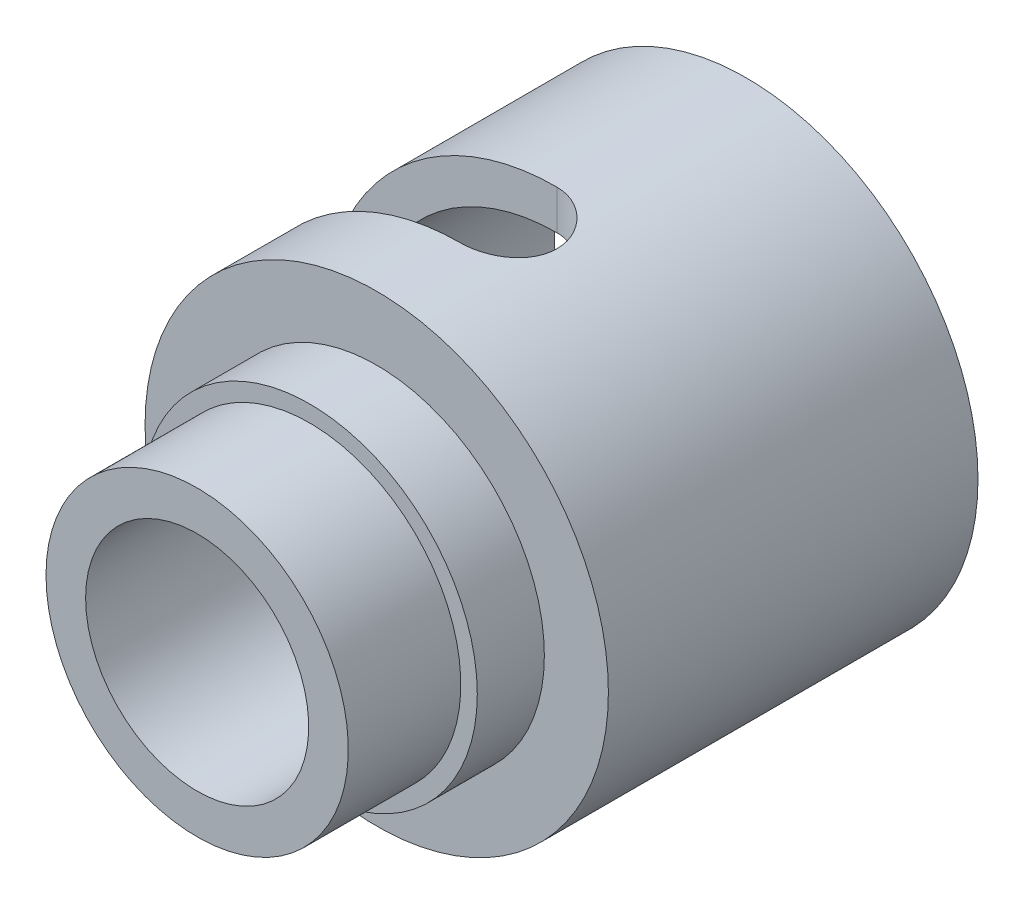
ISO-10303-21;
HEADER;
FILE_DESCRIPTION(('STEP AP214'),'2;1');
FILE_NAME('part.step','',(''),(''),'','','');
FILE_SCHEMA(('AUTOMOTIVE_DESIGN { 1 0 10303 214 1 1 1 1 }'));
ENDSEC;
DATA;
#1=APPLICATION_CONTEXT('core data for automotive mechanical design processes');
#2=APPLICATION_PROTOCOL_DEFINITION('international standard','automotive_design',2000,#1);
#3=PRODUCT_CONTEXT('',#1,'mechanical');
#4=PRODUCT('Part','Part','',(#3));
#5=PRODUCT_RELATED_PRODUCT_CATEGORY('part','',(#4));
#6=PRODUCT_DEFINITION_FORMATION('','',#4);
#7=PRODUCT_DEFINITION_CONTEXT('part definition',#1,'design');
#8=PRODUCT_DEFINITION('design','',#6,#7);
#9=PRODUCT_DEFINITION_SHAPE('','',#8);
#10=(LENGTH_UNIT() NAMED_UNIT(*) SI_UNIT(.MILLI.,.METRE.));
#11=(NAMED_UNIT(*) PLANE_ANGLE_UNIT() SI_UNIT($,.RADIAN.));
#12=(NAMED_UNIT(*) SI_UNIT($,.STERADIAN.) SOLID_ANGLE_UNIT());
#13=UNCERTAINTY_MEASURE_WITH_UNIT(LENGTH_MEASURE(1.E-05),#10,'distance_accuracy_value','');
#14=(GEOMETRIC_REPRESENTATION_CONTEXT(3) GLOBAL_UNCERTAINTY_ASSIGNED_CONTEXT((#13)) GLOBAL_UNIT_ASSIGNED_CONTEXT((#10,
#11,#12)) REPRESENTATION_CONTEXT('',''));
#15=CARTESIAN_POINT('',(0.,0.,0.));
#16=DIRECTION('',(0.,0.,1.));
#17=DIRECTION('',(1.,0.,0.));
#18=AXIS2_PLACEMENT_3D('',#15,#16,#17);
#19=CARTESIAN_POINT('',(0.,0.,0.));
#20=DIRECTION('',(0.,0.,-1.));
#21=DIRECTION('',(-1.,0.,0.));
#22=AXIS2_PLACEMENT_3D('',#19,#20,#21);
#23=CYLINDRICAL_SURFACE('',#22,7.2754);
#24=CARTESIAN_POINT('',(0.,0.,-20.802));
#25=DIRECTION('',(0.,0.,-1.));
#26=DIRECTION('',(-1.,0.,0.));
#27=AXIS2_PLACEMENT_3D('',#24,#25,#26);
#28=CIRCLE('',#27,7.2754);
#29=CARTESIAN_POINT('',(-7.2754,0.,-20.802));
#30=VERTEX_POINT('',#29);
#31=EDGE_CURVE('E154',#30,#30,#28,.T.);
#32=ORIENTED_EDGE('',*,*,#31,.T.);
#33=EDGE_LOOP('',(#32));
#34=FACE_BOUND('',#33,.T.);
#35=CARTESIAN_POINT('',(0.,0.,-7.802));
#36=DIRECTION('',(0.,0.,-1.));
#37=DIRECTION('',(-1.,0.,0.));
#38=AXIS2_PLACEMENT_3D('',#35,#36,#37);
#39=CIRCLE('',#38,7.2754);
#40=CARTESIAN_POINT('',(-7.2754,0.,-7.802));
#41=VERTEX_POINT('',#40);
#42=EDGE_CURVE('E151',#41,#41,#39,.T.);
#43=ORIENTED_EDGE('',*,*,#42,.F.);
#44=EDGE_LOOP('',(#43));
#45=FACE_BOUND('',#44,.T.);
#46=CARTESIAN_POINT('',(-7.2754,0.,-9.9732));
#47=CARTESIAN_POINT('',(-7.27539830402765,-0.101024499946564,-9.97320280234613));
#48=CARTESIAN_POINT('',(-7.27327485266159,-0.202080196573058,-9.9815991741987));
#49=CARTESIAN_POINT('',(-7.26500978027613,-0.401294142732307,-10.0149117852201));
#50=CARTESIAN_POINT('',(-7.25886590940929,-0.499450737749958,-10.0398372742727));
#51=CARTESIAN_POINT('',(-7.24324015798296,-0.689960986716793,-10.1053569311408));
#52=CARTESIAN_POINT('',(-7.23376231088969,-0.782321494408743,-10.1459321714814));
#53=CARTESIAN_POINT('',(-7.21247738243091,-0.958925002909971,-10.2415326746814));
#54=CARTESIAN_POINT('',(-7.20067021626212,-1.04316770800902,-10.2965584636646));
#55=CARTESIAN_POINT('',(-7.17573326326539,-1.20289688977567,-10.4207072107326));
#56=CARTESIAN_POINT('',(-7.16258289181062,-1.27819042998377,-10.4900742770674));
#57=CARTESIAN_POINT('',(-7.13657804400276,-1.41620693804382,-10.6404139312616));
#58=CARTESIAN_POINT('',(-7.12372360156639,-1.47892847129141,-10.7213878417835));
#59=CARTESIAN_POINT('',(-7.09955826488381,-1.59093058935488,-10.8941440590972));
#60=CARTESIAN_POINT('',(-7.08827349027227,-1.63999485862079,-10.9860705946166));
#61=CARTESIAN_POINT('',(-7.06882558457157,-1.72189842322642,-11.1771964936568));
#62=CARTESIAN_POINT('',(-7.06066194843538,-1.75474034383683,-11.2763946774172));
#63=CARTESIAN_POINT('',(-7.0485922757255,-1.80260780974885,-11.4771252578249));
#64=CARTESIAN_POINT('',(-7.04460341265171,-1.81798049186806,-11.5785697775956));
#65=CARTESIAN_POINT('',(-7.0410870325231,-1.83155446153518,-11.7826702894379));
#66=CARTESIAN_POINT('',(-7.04155878117181,-1.82975857533599,-11.8853260793341));
#67=CARTESIAN_POINT('',(-7.04683589616991,-1.80932324260116,-12.0862706981259));
#68=CARTESIAN_POINT('',(-7.05153469853574,-1.79109795781843,-12.184604882051));
#69=CARTESIAN_POINT('',(-7.06456659296153,-1.73898206788859,-12.3767731897796));
#70=CARTESIAN_POINT('',(-7.0728999464572,-1.70509033583279,-12.4706069893283));
#71=CARTESIAN_POINT('',(-7.09235946653254,-1.62225190572411,-12.6522190127621));
#72=CARTESIAN_POINT('',(-7.10351322830426,-1.57315530728083,-12.7399257817411));
#73=CARTESIAN_POINT('',(-7.1273412977001,-1.46140563294241,-12.906004104758));
#74=CARTESIAN_POINT('',(-7.14001587390704,-1.39875016091331,-12.9843740049771));
#75=CARTESIAN_POINT('',(-7.16590574531014,-1.25951819962062,-13.1319267904066));
#76=CARTESIAN_POINT('',(-7.17912609289931,-1.18259234598438,-13.2007795440711));
#77=CARTESIAN_POINT('',(-7.20428843481481,-1.01812734655254,-13.3246705401997));
#78=CARTESIAN_POINT('',(-7.21623038923822,-0.930587869652059,-13.3797083515255));
#79=CARTESIAN_POINT('',(-7.23755091455376,-0.746906299806735,-13.4745302831887));
#80=CARTESIAN_POINT('',(-7.24692035881741,-0.650735144417063,-13.5142602911913));
#81=CARTESIAN_POINT('',(-7.26197384057994,-0.452790912351929,-13.5768972911292));
#82=CARTESIAN_POINT('',(-7.2676585909855,-0.351018923450167,-13.5998075374297));
#83=CARTESIAN_POINT('',(-7.27459648518906,-0.147584117427005,-13.6276493659367));
#84=CARTESIAN_POINT('',(-7.27596040572397,-0.0459865074428848,-13.6330304620862));
#85=CARTESIAN_POINT('',(-7.27441871372347,0.1566577357541,-13.6268948160831));
#86=CARTESIAN_POINT('',(-7.27151349001896,0.257704418303768,-13.6153796128346));
#87=CARTESIAN_POINT('',(-7.26183097878239,0.454813046329619,-13.5761486217887));
#88=CARTESIAN_POINT('',(-7.25511244226587,0.55092703543925,-13.5486785021458));
#89=CARTESIAN_POINT('',(-7.23856093199773,0.737177293925065,-13.4785984362942));
#90=CARTESIAN_POINT('',(-7.22872764174585,0.827312954697677,-13.4359869514685));
#91=CARTESIAN_POINT('',(-7.20677254011678,1.00083305357398,-13.3359655593183));
#92=CARTESIAN_POINT('',(-7.19461292141622,1.08406779801983,-13.2783044580672));
#93=CARTESIAN_POINT('',(-7.16941285769906,1.2398392703405,-13.1501412749587));
#94=CARTESIAN_POINT('',(-7.15637225916173,1.31237412659097,-13.0796369513738));
#95=CARTESIAN_POINT('',(-7.13048052409588,1.44654259372017,-12.9257006855771));
#96=CARTESIAN_POINT('',(-7.11764213635493,1.5078607281826,-12.8419911674274));
#97=CARTESIAN_POINT('',(-7.09396935116463,1.61557961426915,-12.6652056661462));
#98=CARTESIAN_POINT('',(-7.08313486500684,1.66198102629176,-12.5721300979113));
#99=CARTESIAN_POINT('',(-7.06481649831764,1.73820320288498,-12.3797517165542));
#100=CARTESIAN_POINT('',(-7.05731282763733,1.76812216179596,-12.2804897922661));
#101=CARTESIAN_POINT('',(-7.04648770316062,1.81078706726278,-12.0781269929175));
#102=CARTESIAN_POINT('',(-7.04316532273453,1.82353681878783,-11.9750269736463));
#103=CARTESIAN_POINT('',(-7.04115012892888,1.83130094249512,-11.7711264382262));
#104=CARTESIAN_POINT('',(-7.04232563257799,1.82681975952551,-11.6703461260569));
#105=CARTESIAN_POINT('',(-7.04886899295589,1.80140497185587,-11.4710276115858));
#106=CARTESIAN_POINT('',(-7.05423676363589,1.7804717048447,-11.372489363307));
#107=CARTESIAN_POINT('',(-7.06848604601725,1.72302386809477,-11.1810074878381));
#108=CARTESIAN_POINT('',(-7.07734597612278,1.68660489332989,-11.0880334638543));
#109=CARTESIAN_POINT('',(-7.09758410917251,1.59929494143329,-10.9094485509126));
#110=CARTESIAN_POINT('',(-7.10896266512975,1.54840193532217,-10.8238386964618));
#111=CARTESIAN_POINT('',(-7.13333066664447,1.43201131925322,-10.6599770166895));
#112=CARTESIAN_POINT('',(-7.14635466426104,1.36616414923033,-10.5819785809128));
#113=CARTESIAN_POINT('',(-7.17234089323796,1.22241425733302,-10.4379742844702));
#114=CARTESIAN_POINT('',(-7.18530310917109,1.14450867189061,-10.3719712805308));
#115=CARTESIAN_POINT('',(-7.20998939943023,0.97712661207887,-10.2526487568694));
#116=CARTESIAN_POINT('',(-7.22168636365133,0.887463914686861,-10.1995844288468));
#117=CARTESIAN_POINT('',(-7.24223740571885,0.700204149436921,-10.1093665734671));
#118=CARTESIAN_POINT('',(-7.25109350278181,0.602612779189115,-10.0722017388551));
#119=CARTESIAN_POINT('',(-7.26366871794279,0.421008502340967,-10.0203014416514));
#120=CARTESIAN_POINT('',(-7.26803758526761,0.337854398316298,-10.0026768034518));
#121=CARTESIAN_POINT('',(-7.27390382860617,0.16980745351004,-9.9791253548518));
#122=CARTESIAN_POINT('',(-7.27540142552612,0.0849147469988232,-9.9731976445267));
#123=CARTESIAN_POINT('',(-7.2754,0.,-9.9732));
#124=B_SPLINE_CURVE_WITH_KNOTS('',3,(#46,#47,#48,#49,#50,#51,#52,#53,#54,#55,#56,#57,#58,#59,
#60,#61,#62,#63,#64,#65,#66,#67,#68,#69,#70,#71,#72,#73,#74,#75,#76,#77,#78,#79,#80,#81,#82,#83,
#84,#85,#86,#87,#88,#89,#90,#91,#92,#93,#94,#95,#96,#97,#98,#99,#100,#101,#102,#103,#104,#105,
#106,#107,#108,#109,#110,#111,#112,#113,#114,#115,#116,#117,#118,#119,#120,#121,#122,#123),
.UNSPECIFIED.,.T.,.F.,(4,2,2,2,2,2,2,2,2,2,2,2,2,2,2,2,2,2,2,2,2,2,2,2,2,2,2,2,2,2,2,2,2,2,2,2,
2,2,4),(0.,0.302762300730394,0.605694173858794,0.908260811378282,1.21083846644243,
1.51906761782229,1.8273319215424,2.1402320371915,2.45308149945712,2.75959912914612,
3.06606630142926,3.36501748841829,3.66399018271642,3.96600960592029,4.26808244586448,
4.57886693898976,4.8896611299104,5.20154409817887,5.51336670597252,5.81712731388759,
6.12086025719801,6.42003594955192,6.71924205187987,7.0238029360173,7.32841703093051,
7.64059634584569,7.9527618379424,8.2630469160116,8.57326321865359,8.87446789057155,
9.17566638024482,9.47503193168337,9.77443946908728,10.0817380252804,10.3891096693717,
10.7021261624938,11.0149196758842,11.2694219241324,11.5239045910191),.UNSPECIFIED.);
#125=CARTESIAN_POINT('',(-7.2754,0.,-9.9732));
#126=VERTEX_POINT('',#125);
#127=CARTESIAN_POINT('',(-7.2754,0.,-13.6308));
#128=VERTEX_POINT('',#127);
#129=EDGE_CURVE('E109',#126,#128,#124,.T.);
#130=ORIENTED_EDGE('',*,*,#129,.F.);
#131=CARTESIAN_POINT('',(0.,0.,-9.9732));
#132=DIRECTION('',(0.,0.,-1.));
#133=DIRECTION('',(-1.,0.,0.));
#134=AXIS2_PLACEMENT_3D('',#131,#132,#133);
#135=CIRCLE('',#134,7.2754);
#136=CARTESIAN_POINT('',(0.,7.2754,-9.9732));
#137=VERTEX_POINT('',#136);
#138=EDGE_CURVE('E54',#126,#137,#135,.T.);
#139=ORIENTED_EDGE('',*,*,#138,.T.);
#140=CARTESIAN_POINT('',(0.,7.2754,-13.6308));
#141=CARTESIAN_POINT('',(-0.101024499946564,7.27539830402765,-13.6307971976539));
#142=CARTESIAN_POINT('',(-0.202080196573058,7.27327485266159,-13.6224008258013));
#143=CARTESIAN_POINT('',(-0.401294142732307,7.26500978027613,-13.5890882147799));
#144=CARTESIAN_POINT('',(-0.499450737749958,7.25886590940929,-13.5641627257273));
#145=CARTESIAN_POINT('',(-0.689960986716793,7.24324015798296,-13.4986430688592));
#146=CARTESIAN_POINT('',(-0.782321494408743,7.23376231088969,-13.4580678285186));
#147=CARTESIAN_POINT('',(-0.958925002909971,7.21247738243091,-13.3624673253186));
#148=CARTESIAN_POINT('',(-1.04316770800902,7.20067021626212,-13.3074415363354));
#149=CARTESIAN_POINT('',(-1.20289688977567,7.17573326326539,-13.1832927892674));
#150=CARTESIAN_POINT('',(-1.27819042998377,7.16258289181062,-13.1139257229326));
#151=CARTESIAN_POINT('',(-1.41620693804382,7.13657804400276,-12.9635860687384));
#152=CARTESIAN_POINT('',(-1.47892847129141,7.12372360156639,-12.8826121582165));
#153=CARTESIAN_POINT('',(-1.59093058935488,7.09955826488381,-12.7098559409028));
#154=CARTESIAN_POINT('',(-1.63999485862079,7.08827349027227,-12.6179294053834));
#155=CARTESIAN_POINT('',(-1.72189842322642,7.06882558457157,-12.4268035063432));
#156=CARTESIAN_POINT('',(-1.75474034383683,7.06066194843538,-12.3276053225828));
#157=CARTESIAN_POINT('',(-1.80260780974885,7.0485922757255,-12.126874742175));
#158=CARTESIAN_POINT('',(-1.81798049186806,7.04460341265171,-12.0254302224044));
#159=CARTESIAN_POINT('',(-1.83155446153518,7.0410870325231,-11.8213297105621));
#160=CARTESIAN_POINT('',(-1.82975857533599,7.04155878117181,-11.7186739206659));
#161=CARTESIAN_POINT('',(-1.80932324260115,7.04683589616991,-11.5177293018741));
#162=CARTESIAN_POINT('',(-1.79109795781843,7.05153469853574,-11.419395117949));
#163=CARTESIAN_POINT('',(-1.73898206788859,7.06456659296153,-11.2272268102204));
#164=CARTESIAN_POINT('',(-1.70509033583279,7.0728999464572,-11.1333930106717));
#165=CARTESIAN_POINT('',(-1.62225190572411,7.09235946653254,-10.9517809872379));
#166=CARTESIAN_POINT('',(-1.57315530728083,7.10351322830426,-10.8640742182589));
#167=CARTESIAN_POINT('',(-1.4614056329424,7.1273412977001,-10.697995895242));
#168=CARTESIAN_POINT('',(-1.39875016091331,7.14001587390704,-10.6196259950229));
#169=CARTESIAN_POINT('',(-1.25951819962062,7.16590574531014,-10.4720732095934));
#170=CARTESIAN_POINT('',(-1.18259234598438,7.17912609289931,-10.4032204559289));
#171=CARTESIAN_POINT('',(-1.01812734655254,7.20428843481481,-10.2793294598003));
#172=CARTESIAN_POINT('',(-0.930587869652058,7.21623038923822,-10.2242916484745));
#173=CARTESIAN_POINT('',(-0.746906299806734,7.23755091455376,-10.1294697168113));
#174=CARTESIAN_POINT('',(-0.650735144417063,7.24692035881741,-10.0897397088087));
#175=CARTESIAN_POINT('',(-0.452790912351929,7.26197384057994,-10.0271027088708));
#176=CARTESIAN_POINT('',(-0.351018923450168,7.2676585909855,-10.0041924625703));
#177=CARTESIAN_POINT('',(-0.147584117427006,7.27459648518906,-9.97635063406334));
#178=CARTESIAN_POINT('',(-0.0459865074428852,7.27596040572397,-9.97096953791384));
#179=CARTESIAN_POINT('',(0.156657735754099,7.27441871372347,-9.97710518391693));
#180=CARTESIAN_POINT('',(0.257704418303767,7.27151349001896,-9.98862038716539));
#181=CARTESIAN_POINT('',(0.454813046329619,7.26183097878239,-10.0278513782113));
#182=CARTESIAN_POINT('',(0.55092703543925,7.25511244226587,-10.0553214978542));
#183=CARTESIAN_POINT('',(0.737177293925065,7.23856093199773,-10.1254015637058));
#184=CARTESIAN_POINT('',(0.827312954697677,7.22872764174585,-10.1680130485315));
#185=CARTESIAN_POINT('',(1.00083305357397,7.20677254011678,-10.2680344406817));
#186=CARTESIAN_POINT('',(1.08406779801983,7.19461292141622,-10.3256955419328));
#187=CARTESIAN_POINT('',(1.2398392703405,7.16941285769906,-10.4538587250413));
#188=CARTESIAN_POINT('',(1.31237412659097,7.15637225916173,-10.5243630486262));
#189=CARTESIAN_POINT('',(1.44654259372017,7.13048052409588,-10.6782993144229));
#190=CARTESIAN_POINT('',(1.5078607281826,7.11764213635493,-10.7620088325726));
#191=CARTESIAN_POINT('',(1.61557961426915,7.09396935116463,-10.9387943338538));
#192=CARTESIAN_POINT('',(1.66198102629176,7.08313486500684,-11.0318699020887));
#193=CARTESIAN_POINT('',(1.73820320288498,7.06481649831764,-11.2242482834458));
#194=CARTESIAN_POINT('',(1.76812216179596,7.05731282763733,-11.3235102077339));
#195=CARTESIAN_POINT('',(1.81078706726278,7.04648770316062,-11.5258730070825));
#196=CARTESIAN_POINT('',(1.82353681878782,7.04316532273453,-11.6289730263537));
#197=CARTESIAN_POINT('',(1.83130094249512,7.04115012892888,-11.8328735617738));
#198=CARTESIAN_POINT('',(1.82681975952551,7.04232563257799,-11.9336538739431));
#199=CARTESIAN_POINT('',(1.80140497185587,7.04886899295589,-12.1329723884142));
#200=CARTESIAN_POINT('',(1.7804717048447,7.05423676363589,-12.231510636693));
#201=CARTESIAN_POINT('',(1.72302386809477,7.06848604601725,-12.4229925121619));
#202=CARTESIAN_POINT('',(1.68660489332989,7.07734597612278,-12.5159665361457));
#203=CARTESIAN_POINT('',(1.59929494143329,7.09758410917251,-12.6945514490874));
#204=CARTESIAN_POINT('',(1.54840193532217,7.10896266512975,-12.7801613035382));
#205=CARTESIAN_POINT('',(1.43201131925322,7.13333066664447,-12.9440229833105));
#206=CARTESIAN_POINT('',(1.36616414923033,7.14635466426104,-13.0220214190872));
#207=CARTESIAN_POINT('',(1.22241425733302,7.17234089323796,-13.1660257155298));
#208=CARTESIAN_POINT('',(1.14450867189061,7.18530310917109,-13.2320287194692));
#209=CARTESIAN_POINT('',(0.97712661207887,7.20998939943023,-13.3513512431306));
#210=CARTESIAN_POINT('',(0.887463914686862,7.22168636365133,-13.4044155711532));
#211=CARTESIAN_POINT('',(0.700204149436921,7.24223740571885,-13.4946334265329));
#212=CARTESIAN_POINT('',(0.602612779189114,7.25109350278181,-13.5317982611449));
#213=CARTESIAN_POINT('',(0.421008502340966,7.26366871794279,-13.5836985583486));
#214=CARTESIAN_POINT('',(0.337854398316297,7.26803758526761,-13.6013231965482));
#215=CARTESIAN_POINT('',(0.169807453510039,7.27390382860617,-13.6248746451482));
#216=CARTESIAN_POINT('',(0.0849147469988227,7.27540142552612,-13.6308023554733));
#217=CARTESIAN_POINT('',(0.,7.2754,-13.6308));
#218=B_SPLINE_CURVE_WITH_KNOTS('',3,(#140,#141,#142,#143,#144,#145,#146,#147,#148,#149,#150,
#151,#152,#153,#154,#155,#156,#157,#158,#159,#160,#161,#162,#163,#164,#165,#166,#167,#168,#169,
#170,#171,#172,#173,#174,#175,#176,#177,#178,#179,#180,#181,#182,#183,#184,#185,#186,#187,#188,
#189,#190,#191,#192,#193,#194,#195,#196,#197,#198,#199,#200,#201,#202,#203,#204,#205,#206,#207,
#208,#209,#210,#211,#212,#213,#214,#215,#216,#217),.UNSPECIFIED.,.T.,.F.,(4,2,2,2,2,2,2,2,2,2,2,
2,2,2,2,2,2,2,2,2,2,2,2,2,2,2,2,2,2,2,2,2,2,2,2,2,2,2,4),(0.,0.302762300730394,
0.605694173858794,0.908260811378284,1.21083846644243,1.51906761782228,1.8273319215424,
2.1402320371915,2.45308149945712,2.75959912914612,3.06606630142925,3.36501748841828,
3.66399018271642,3.96600960592029,4.26808244586448,4.57886693898976,4.8896611299104,
5.20154409817887,5.51336670597252,5.81712731388759,6.12086025719801,6.42003594955192,
6.71924205187986,7.0238029360173,7.32841703093051,7.64059634584569,7.95276183794239,
8.2630469160116,8.57326321865359,8.87446789057155,9.17566638024482,9.47503193168337,
9.77443946908728,10.0817380252804,10.3891096693717,10.7021261624938,11.0149196758842,
11.2694219241324,11.5239045910191),.UNSPECIFIED.);
#219=CARTESIAN_POINT('',(0.,7.2754,-13.6308));
#220=VERTEX_POINT('',#219);
#221=EDGE_CURVE('E115',#137,#220,#218,.T.);
#222=ORIENTED_EDGE('',*,*,#221,.T.);
#223=CARTESIAN_POINT('',(0.,0.,-13.6308));
#224=DIRECTION('',(0.,0.,1.));
#225=DIRECTION('',(1.,0.,0.));
#226=AXIS2_PLACEMENT_3D('',#223,#224,#225);
#227=CIRCLE('',#226,7.2754);
#228=EDGE_CURVE('E176',#220,#128,#227,.T.);
#229=ORIENTED_EDGE('',*,*,#228,.T.);
#230=EDGE_LOOP('',(#130,#139,#222,#229));
#231=FACE_BOUND('',#230,.T.);
#232=ADVANCED_FACE('F32',(#34,#45,#231),#23,.F.);
#233=CARTESIAN_POINT('',(0.,0.,0.));
#234=DIRECTION('',(0.,0.,-1.));
#235=DIRECTION('',(-1.,0.,0.));
#236=AXIS2_PLACEMENT_3D('',#233,#234,#235);
#237=CYLINDRICAL_SURFACE('',#236,8.7754);
#238=CARTESIAN_POINT('',(0.,0.,-20.802));
#239=DIRECTION('',(0.,0.,-1.));
#240=DIRECTION('',(-1.,0.,0.));
#241=AXIS2_PLACEMENT_3D('',#238,#239,#240);
#242=CIRCLE('',#241,8.7754);
#243=CARTESIAN_POINT('',(-8.7754,0.,-20.802));
#244=VERTEX_POINT('',#243);
#245=EDGE_CURVE('E157',#244,#244,#242,.T.);
#246=ORIENTED_EDGE('',*,*,#245,.F.);
#247=EDGE_LOOP('',(#246));
#248=FACE_BOUND('',#247,.T.);
#249=CARTESIAN_POINT('',(0.,0.,-6.802));
#250=DIRECTION('',(0.,0.,-1.));
#251=DIRECTION('',(-1.,0.,0.));
#252=AXIS2_PLACEMENT_3D('',#249,#250,#251);
#253=CIRCLE('',#252,8.7754);
#254=CARTESIAN_POINT('',(-8.7754,0.,-6.802));
#255=VERTEX_POINT('',#254);
#256=EDGE_CURVE('E160',#255,#255,#253,.T.);
#257=ORIENTED_EDGE('',*,*,#256,.T.);
#258=EDGE_LOOP('',(#257));
#259=FACE_BOUND('',#258,.T.);
#260=CARTESIAN_POINT('',(0.,8.7754,-13.6308));
#261=CARTESIAN_POINT('',(0.10154745520499,8.7753981203777,-13.6307963763394));
#262=CARTESIAN_POINT('',(0.203139815312618,8.77361935212919,-13.622313519323));
#263=CARTESIAN_POINT('',(0.403446752560768,8.76669516646164,-13.5886367873723));
#264=CARTESIAN_POINT('',(0.50215908468632,8.76154719228181,-13.5634302212587));
#265=CARTESIAN_POINT('',(0.69378145441355,8.74845871485918,-13.4971235538538));
#266=CARTESIAN_POINT('',(0.786697164670047,8.74052099382925,-13.4560392833358));
#267=CARTESIAN_POINT('',(0.964311687882757,8.72271320369663,-13.3591919070389));
#268=CARTESIAN_POINT('',(1.04901086772063,8.71284322093208,-13.3034294570782));
#269=CARTESIAN_POINT('',(1.20903333046384,8.69209338875596,-13.1779436329455));
#270=CARTESIAN_POINT('',(1.28421900896568,8.6812019880164,-13.1080466760831));
#271=CARTESIAN_POINT('',(1.42188798935602,8.65971971645554,-12.9566488909918));
#272=CARTESIAN_POINT('',(1.48437023947592,8.64912887058081,-12.8751471029006));
#273=CARTESIAN_POINT('',(1.5954538130211,8.62933358947198,-12.7018512654475));
#274=CARTESIAN_POINT('',(1.64391089555173,8.62014399118412,-12.609962911494));
#275=CARTESIAN_POINT('',(1.72464404781347,8.60435653125473,-12.4191249293698));
#276=CARTESIAN_POINT('',(1.7569218620482,8.5977583902101,-12.3201760638022));
#277=CARTESIAN_POINT('',(1.80392996759681,8.58801813690634,-12.1195117847331));
#278=CARTESIAN_POINT('',(1.81890266680244,8.58482833028083,-12.0178555216289));
#279=CARTESIAN_POINT('',(1.83162881636124,8.5821224929973,-11.8134276738562));
#280=CARTESIAN_POINT('',(1.82938418226933,8.58260605365009,-11.710656214532));
#281=CARTESIAN_POINT('',(1.80793497030298,8.58714904788836,-11.5087012272008));
#282=CARTESIAN_POINT('',(1.78900989378535,8.59114954799072,-11.4094864891196));
#283=CARTESIAN_POINT('',(1.73517890735655,8.60218270472337,-11.2156718208842));
#284=CARTESIAN_POINT('',(1.70027217548909,8.60921551730817,-11.1210721283644));
#285=CARTESIAN_POINT('',(1.61520637758596,8.6255801751596,-10.9383760674622));
#286=CARTESIAN_POINT('',(1.56493798326886,8.63492840570608,-10.8503321324414));
#287=CARTESIAN_POINT('',(1.4506528156786,8.65486027940803,-10.6838249039588));
#288=CARTESIAN_POINT('',(1.38663433293056,8.66544407610007,-10.6053628036595));
#289=CARTESIAN_POINT('',(1.24517716990417,8.68690879952454,-10.4586352636009));
#290=CARTESIAN_POINT('',(1.16750031864218,8.69779148705814,-10.3905994901592));
#291=CARTESIAN_POINT('',(1.0017190109104,8.71843853389646,-10.2684853565132));
#292=CARTESIAN_POINT('',(0.913614397812356,8.72820287639894,-10.2144072059957));
#293=CARTESIAN_POINT('',(0.729212390007122,8.74554030513262,-10.1216947030675));
#294=CARTESIAN_POINT('',(0.632900554030083,8.75310942119838,-10.0830882844422));
#295=CARTESIAN_POINT('',(0.434964642322906,8.76517373004748,-10.0226690591246));
#296=CARTESIAN_POINT('',(0.333341268299398,8.76966932777359,-10.000854040081));
#297=CARTESIAN_POINT('',(0.129639016115997,8.77502312783656,-9.97496590638582));
#298=CARTESIAN_POINT('',(0.0276016910604395,8.77594570737555,-9.97057874593486));
#299=CARTESIAN_POINT('',(-0.17574787953681,8.77422903098526,-9.97882271701867));
#300=CARTESIAN_POINT('',(-0.277060169123695,8.77158999329929,-9.99145280579661));
#301=CARTESIAN_POINT('',(-0.475058641676518,8.76308704209596,-10.0331120414028));
#302=CARTESIAN_POINT('',(-0.571780554665351,8.75725514023949,-10.0619784799239));
#303=CARTESIAN_POINT('',(-0.759010613080584,8.74301844364752,-10.1351119779543));
#304=CARTESIAN_POINT('',(-0.849518263331501,8.7346134441687,-10.1793802630384));
#305=CARTESIAN_POINT('',(-1.02306377048913,8.71600312652698,-10.2827292176717));
#306=CARTESIAN_POINT('',(-1.10598779155367,8.70577559444134,-10.3419969558582));
#307=CARTESIAN_POINT('',(-1.26082602757566,8.68470378339341,-10.4734137760504));
#308=CARTESIAN_POINT('',(-1.33273895148748,8.67385943231354,-10.545564366419));
#309=CARTESIAN_POINT('',(-1.46473873658952,8.65255683861706,-10.7021336297793));
#310=CARTESIAN_POINT('',(-1.5246091581724,8.64210800998079,-10.7867362868373));
#311=CARTESIAN_POINT('',(-1.62929118990319,8.62298663911804,-10.9649812415769));
#312=CARTESIAN_POINT('',(-1.67410342720537,8.61431402292043,-11.0586231625754));
#313=CARTESIAN_POINT('',(-1.7471097367496,8.59980463195802,-11.2518009470642));
#314=CARTESIAN_POINT('',(-1.77539353792439,8.59395257601466,-11.3513016965911));
#315=CARTESIAN_POINT('',(-1.8148084699974,8.58571651903388,-11.5537796362718));
#316=CARTESIAN_POINT('',(-1.82594205636708,8.58333202153365,-11.6567563266021));
#317=CARTESIAN_POINT('',(-1.83064360543862,8.58233027318955,-11.8610860282008));
#318=CARTESIAN_POINT('',(-1.82455406330593,8.58363956715171,-11.9624309516427));
#319=CARTESIAN_POINT('',(-1.79574239556624,8.58971287833684,-12.1626173281634));
#320=CARTESIAN_POINT('',(-1.77302042982587,8.59447686235421,-12.2614588052953));
#321=CARTESIAN_POINT('',(-1.71174734238665,8.6068886146282,-12.4535908810721));
#322=CARTESIAN_POINT('',(-1.67324166674351,8.61452809833497,-12.5468965432511));
#323=CARTESIAN_POINT('',(-1.5815349710558,8.63183411773578,-12.725775623023));
#324=CARTESIAN_POINT('',(-1.52833258570574,8.64150084173774,-12.8113483212529));
#325=CARTESIAN_POINT('',(-1.40758771501637,8.66199457083746,-12.9740304065919));
#326=CARTESIAN_POINT('',(-1.33979929588934,8.67283965806845,-13.0509550146099));
#327=CARTESIAN_POINT('',(-1.19231038023224,8.6943420713597,-13.1924499085703));
#328=CARTESIAN_POINT('',(-1.11260714492377,8.70499935361921,-13.2570173462519));
#329=CARTESIAN_POINT('',(-0.942444063084885,8.7250708115445,-13.3726732712135));
#330=CARTESIAN_POINT('',(-0.851870688023503,8.73446922060162,-13.4235975936439));
#331=CARTESIAN_POINT('',(-0.663277733860817,8.75080761344907,-13.509420737058));
#332=CARTESIAN_POINT('',(-0.565264751154631,8.75774974489754,-13.5443335657195));
#333=CARTESIAN_POINT('',(-0.389236179895465,8.76709262196151,-13.5906158999547));
#334=CARTESIAN_POINT('',(-0.312201761091319,8.77018919585705,-13.6056572571016));
#335=CARTESIAN_POINT('',(-0.156787118596334,8.77434357281176,-13.6257505212945));
#336=CARTESIAN_POINT('',(-0.0784069448024592,8.77540145129626,-13.6308027979052));
#337=CARTESIAN_POINT('',(0.,8.7754,-13.6308));
#338=B_SPLINE_CURVE_WITH_KNOTS('',3,(#260,#261,#262,#263,#264,#265,#266,#267,#268,#269,#270,
#271,#272,#273,#274,#275,#276,#277,#278,#279,#280,#281,#282,#283,#284,#285,#286,#287,#288,#289,
#290,#291,#292,#293,#294,#295,#296,#297,#298,#299,#300,#301,#302,#303,#304,#305,#306,#307,#308,
#309,#310,#311,#312,#313,#314,#315,#316,#317,#318,#319,#320,#321,#322,#323,#324,#325,#326,#327,
#328,#329,#330,#331,#332,#333,#334,#335,#336,#337),.UNSPECIFIED.,.T.,.F.,(4,2,2,2,2,2,2,2,2,2,2,
2,2,2,2,2,2,2,2,2,2,2,2,2,2,2,2,2,2,2,2,2,2,2,2,2,2,2,4),(0.,0.304355458355814,0.60894214858434,
0.913225932652467,1.21749612368703,1.52575868048738,1.834046749217,2.14540105660965,
2.45672178549912,2.76362659766936,3.07049726491799,3.37232165938402,3.67416157879596,
3.97820178535713,4.28227981351204,4.59231020415178,4.90234525213657,5.21293756495292,
5.52348894866341,5.82841817717456,6.13332872155071,6.43523677285809,6.73716885346501,
7.04307003049947,7.34900704687401,7.66002930330439,7.9710386044464,8.28034343735477,
8.58960398161623,8.89275813088797,9.19590936635753,9.49819380179478,9.80050632851764,
10.1083835579179,10.4163316661093,10.727833890718,11.0390630748581,11.2740710768093,
11.5090703840342),.UNSPECIFIED.);
#339=CARTESIAN_POINT('',(0.,8.7754,-13.6308));
#340=VERTEX_POINT('',#339);
#341=CARTESIAN_POINT('',(0.,8.7754,-9.9732));
#342=VERTEX_POINT('',#341);
#343=EDGE_CURVE('E82',#340,#342,#338,.T.);
#344=ORIENTED_EDGE('',*,*,#343,.T.);
#345=CARTESIAN_POINT('',(0.,0.,-9.9732));
#346=DIRECTION('',(0.,0.,-1.));
#347=DIRECTION('',(-1.,0.,0.));
#348=AXIS2_PLACEMENT_3D('',#345,#346,#347);
#349=CIRCLE('',#348,8.7754);
#350=CARTESIAN_POINT('',(-8.7754,0.,-9.9732));
#351=VERTEX_POINT('',#350);
#352=EDGE_CURVE('E71',#351,#342,#349,.T.);
#353=ORIENTED_EDGE('',*,*,#352,.F.);
#354=CARTESIAN_POINT('',(-8.7754,0.,-13.6308));
#355=CARTESIAN_POINT('',(-8.7753981203777,-0.10154745520499,-13.6307963763394));
#356=CARTESIAN_POINT('',(-8.77361935212919,-0.203139815312618,-13.622313519323));
#357=CARTESIAN_POINT('',(-8.76669516646164,-0.403446752560768,-13.5886367873723));
#358=CARTESIAN_POINT('',(-8.76154719228181,-0.50215908468632,-13.5634302212587));
#359=CARTESIAN_POINT('',(-8.74845871485918,-0.69378145441355,-13.4971235538538));
#360=CARTESIAN_POINT('',(-8.74052099382925,-0.786697164670048,-13.4560392833358));
#361=CARTESIAN_POINT('',(-8.72271320369664,-0.964311687882758,-13.3591919070389));
#362=CARTESIAN_POINT('',(-8.71284322093208,-1.04901086772063,-13.3034294570782));
#363=CARTESIAN_POINT('',(-8.69209338875596,-1.20903333046384,-13.1779436329455));
#364=CARTESIAN_POINT('',(-8.6812019880164,-1.28421900896568,-13.1080466760831));
#365=CARTESIAN_POINT('',(-8.65971971645554,-1.42188798935602,-12.9566488909918));
#366=CARTESIAN_POINT('',(-8.64912887058081,-1.48437023947593,-12.8751471029006));
#367=CARTESIAN_POINT('',(-8.62933358947198,-1.5954538130211,-12.7018512654475));
#368=CARTESIAN_POINT('',(-8.62014399118412,-1.64391089555173,-12.609962911494));
#369=CARTESIAN_POINT('',(-8.60435653125473,-1.72464404781348,-12.4191249293698));
#370=CARTESIAN_POINT('',(-8.5977583902101,-1.7569218620482,-12.3201760638022));
#371=CARTESIAN_POINT('',(-8.58801813690634,-1.80392996759681,-12.1195117847331));
#372=CARTESIAN_POINT('',(-8.58482833028083,-1.81890266680244,-12.0178555216289));
#373=CARTESIAN_POINT('',(-8.5821224929973,-1.83162881636124,-11.8134276738562));
#374=CARTESIAN_POINT('',(-8.58260605365009,-1.82938418226934,-11.710656214532));
#375=CARTESIAN_POINT('',(-8.58714904788836,-1.80793497030298,-11.5087012272008));
#376=CARTESIAN_POINT('',(-8.59114954799072,-1.78900989378535,-11.4094864891196));
#377=CARTESIAN_POINT('',(-8.60218270472337,-1.73517890735655,-11.2156718208842));
#378=CARTESIAN_POINT('',(-8.60921551730817,-1.70027217548909,-11.1210721283644));
#379=CARTESIAN_POINT('',(-8.6255801751596,-1.61520637758596,-10.9383760674622));
#380=CARTESIAN_POINT('',(-8.63492840570608,-1.56493798326886,-10.8503321324414));
#381=CARTESIAN_POINT('',(-8.65486027940803,-1.4506528156786,-10.6838249039588));
#382=CARTESIAN_POINT('',(-8.66544407610007,-1.38663433293056,-10.6053628036595));
#383=CARTESIAN_POINT('',(-8.68690879952454,-1.24517716990417,-10.4586352636009));
#384=CARTESIAN_POINT('',(-8.69779148705814,-1.16750031864218,-10.3905994901592));
#385=CARTESIAN_POINT('',(-8.71843853389646,-1.0017190109104,-10.2684853565132));
#386=CARTESIAN_POINT('',(-8.72820287639894,-0.913614397812356,-10.2144072059957));
#387=CARTESIAN_POINT('',(-8.74554030513262,-0.729212390007122,-10.1216947030675));
#388=CARTESIAN_POINT('',(-8.75310942119838,-0.632900554030082,-10.0830882844422));
#389=CARTESIAN_POINT('',(-8.76517373004748,-0.434964642322906,-10.0226690591246));
#390=CARTESIAN_POINT('',(-8.76966932777359,-0.333341268299399,-10.000854040081));
#391=CARTESIAN_POINT('',(-8.77502312783656,-0.129639016115998,-9.97496590638582));
#392=CARTESIAN_POINT('',(-8.77594570737555,-0.0276016910604406,-9.97057874593486));
#393=CARTESIAN_POINT('',(-8.77422903098526,0.175747879536809,-9.97882271701867));
#394=CARTESIAN_POINT('',(-8.77158999329929,0.277060169123694,-9.99145280579661));
#395=CARTESIAN_POINT('',(-8.76308704209596,0.475058641676517,-10.0331120414028));
#396=CARTESIAN_POINT('',(-8.75725514023949,0.57178055466535,-10.0619784799239));
#397=CARTESIAN_POINT('',(-8.74301844364752,0.759010613080584,-10.1351119779543));
#398=CARTESIAN_POINT('',(-8.7346134441687,0.849518263331501,-10.1793802630384));
#399=CARTESIAN_POINT('',(-8.71600312652698,1.02306377048913,-10.2827292176717));
#400=CARTESIAN_POINT('',(-8.70577559444134,1.10598779155367,-10.3419969558582));
#401=CARTESIAN_POINT('',(-8.68470378339341,1.26082602757566,-10.4734137760504));
#402=CARTESIAN_POINT('',(-8.67385943231354,1.33273895148748,-10.545564366419));
#403=CARTESIAN_POINT('',(-8.65255683861706,1.46473873658952,-10.7021336297793));
#404=CARTESIAN_POINT('',(-8.64210800998079,1.5246091581724,-10.7867362868373));
#405=CARTESIAN_POINT('',(-8.62298663911804,1.62929118990319,-10.9649812415769));
#406=CARTESIAN_POINT('',(-8.61431402292043,1.67410342720537,-11.0586231625754));
#407=CARTESIAN_POINT('',(-8.59980463195802,1.7471097367496,-11.2518009470642));
#408=CARTESIAN_POINT('',(-8.59395257601466,1.77539353792439,-11.3513016965911));
#409=CARTESIAN_POINT('',(-8.58571651903388,1.8148084699974,-11.5537796362718));
#410=CARTESIAN_POINT('',(-8.58333202153365,1.82594205636708,-11.6567563266021));
#411=CARTESIAN_POINT('',(-8.58233027318955,1.83064360543862,-11.8610860282008));
#412=CARTESIAN_POINT('',(-8.58363956715171,1.82455406330593,-11.9624309516427));
#413=CARTESIAN_POINT('',(-8.58971287833684,1.79574239556624,-12.1626173281634));
#414=CARTESIAN_POINT('',(-8.59447686235421,1.77302042982587,-12.2614588052953));
#415=CARTESIAN_POINT('',(-8.6068886146282,1.71174734238665,-12.4535908810721));
#416=CARTESIAN_POINT('',(-8.61452809833497,1.67324166674351,-12.5468965432511));
#417=CARTESIAN_POINT('',(-8.63183411773578,1.5815349710558,-12.725775623023));
#418=CARTESIAN_POINT('',(-8.64150084173774,1.52833258570574,-12.8113483212529));
#419=CARTESIAN_POINT('',(-8.66199457083746,1.40758771501637,-12.9740304065919));
#420=CARTESIAN_POINT('',(-8.67283965806845,1.33979929588934,-13.0509550146099));
#421=CARTESIAN_POINT('',(-8.6943420713597,1.19231038023224,-13.1924499085703));
#422=CARTESIAN_POINT('',(-8.70499935361921,1.11260714492377,-13.2570173462519));
#423=CARTESIAN_POINT('',(-8.7250708115445,0.942444063084888,-13.3726732712135));
#424=CARTESIAN_POINT('',(-8.73446922060162,0.851870688023505,-13.4235975936439));
#425=CARTESIAN_POINT('',(-8.75080761344907,0.663277733860818,-13.509420737058));
#426=CARTESIAN_POINT('',(-8.75774974489754,0.565264751154633,-13.5443335657195));
#427=CARTESIAN_POINT('',(-8.76709262196151,0.389236179895467,-13.5906158999547));
#428=CARTESIAN_POINT('',(-8.77018919585705,0.312201761091321,-13.6056572571016));
#429=CARTESIAN_POINT('',(-8.77434357281176,0.156787118596335,-13.6257505212945));
#430=CARTESIAN_POINT('',(-8.77540145129626,0.07840694480246,-13.6308027979052));
#431=CARTESIAN_POINT('',(-8.7754,0.,-13.6308));
#432=B_SPLINE_CURVE_WITH_KNOTS('',3,(#354,#355,#356,#357,#358,#359,#360,#361,#362,#363,#364,
#365,#366,#367,#368,#369,#370,#371,#372,#373,#374,#375,#376,#377,#378,#379,#380,#381,#382,#383,
#384,#385,#386,#387,#388,#389,#390,#391,#392,#393,#394,#395,#396,#397,#398,#399,#400,#401,#402,
#403,#404,#405,#406,#407,#408,#409,#410,#411,#412,#413,#414,#415,#416,#417,#418,#419,#420,#421,
#422,#423,#424,#425,#426,#427,#428,#429,#430,#431),.UNSPECIFIED.,.T.,.F.,(4,2,2,2,2,2,2,2,2,2,2,
2,2,2,2,2,2,2,2,2,2,2,2,2,2,2,2,2,2,2,2,2,2,2,2,2,2,2,4),(0.,0.304355458355814,
0.608942148584341,0.913225932652468,1.21749612368703,1.52575868048738,1.834046749217,
2.14540105660965,2.45672178549912,2.76362659766936,3.07049726491799,3.37232165938402,
3.67416157879596,3.97820178535713,4.28227981351204,4.59231020415178,4.90234525213657,
5.21293756495293,5.52348894866341,5.82841817717456,6.13332872155071,6.43523677285809,
6.73716885346501,7.04307003049947,7.34900704687401,7.66002930330439,7.97103860444641,
8.28034343735477,8.58960398161623,8.89275813088797,9.19590936635753,9.49819380179478,
9.80050632851764,10.1083835579179,10.4163316661093,10.727833890718,11.0390630748581,
11.2740710768093,11.5090703840342),.UNSPECIFIED.);
#433=CARTESIAN_POINT('',(-8.7754,0.,-13.6308));
#434=VERTEX_POINT('',#433);
#435=EDGE_CURVE('E40',#434,#351,#432,.T.);
#436=ORIENTED_EDGE('',*,*,#435,.F.);
#437=CARTESIAN_POINT('',(0.,0.,-13.6308));
#438=DIRECTION('',(0.,0.,1.));
#439=DIRECTION('',(1.,0.,0.));
#440=AXIS2_PLACEMENT_3D('',#437,#438,#439);
#441=CIRCLE('',#440,8.7754);
#442=EDGE_CURVE('E47',#340,#434,#441,.T.);
#443=ORIENTED_EDGE('',*,*,#442,.F.);
#444=EDGE_LOOP('',(#344,#353,#436,#443));
#445=FACE_BOUND('',#444,.T.);
#446=ADVANCED_FACE('F80',(#248,#259,#445),#237,.T.);
#447=CARTESIAN_POINT('',(0.,8.7754,-11.802));
#448=DIRECTION('',(0.,-1.,0.));
#449=DIRECTION('',(0.,0.,-1.));
#450=AXIS2_PLACEMENT_3D('',#447,#448,#449);
#451=CYLINDRICAL_SURFACE('',#450,1.8288);
#452=ORIENTED_EDGE('',*,*,#221,.F.);
#453=DIRECTION('',(0.,-1.,0.));
#454=VECTOR('',#453,1.);
#455=CARTESIAN_POINT('',(0.,0.,-9.9732));
#456=LINE('',#455,#454);
#457=EDGE_CURVE('E83',#342,#137,#456,.T.);
#458=ORIENTED_EDGE('',*,*,#457,.F.);
#459=ORIENTED_EDGE('',*,*,#343,.F.);
#460=DIRECTION('',(0.,1.,0.));
#461=VECTOR('',#460,1.);
#462=CARTESIAN_POINT('',(0.,0.,-13.6308));
#463=LINE('',#462,#461);
#464=EDGE_CURVE('E179',#220,#340,#463,.T.);
#465=ORIENTED_EDGE('',*,*,#464,.F.);
#466=EDGE_LOOP('',(#452,#458,#459,#465));
#467=FACE_BOUND('',#466,.T.);
#468=ADVANCED_FACE('F103',(#467),#451,.F.);
#469=CARTESIAN_POINT('',(-8.7754,0.,-11.802));
#470=DIRECTION('',(1.,0.,0.));
#471=DIRECTION('',(0.,0.,-1.));
#472=AXIS2_PLACEMENT_3D('',#469,#470,#471);
#473=CYLINDRICAL_SURFACE('',#472,1.8288);
#474=DIRECTION('',(1.,0.,0.));
#475=VECTOR('',#474,1.);
#476=CARTESIAN_POINT('',(-8.7754,0.,-9.9732));
#477=LINE('',#476,#475);
#478=EDGE_CURVE('E11',#126,#351,#477,.F.);
#479=ORIENTED_EDGE('',*,*,#478,.F.);
#480=ORIENTED_EDGE('',*,*,#129,.T.);
#481=DIRECTION('',(1.,0.,0.));
#482=VECTOR('',#481,1.);
#483=CARTESIAN_POINT('',(0.,0.,-13.6308));
#484=LINE('',#483,#482);
#485=EDGE_CURVE('E86',#434,#128,#484,.T.);
#486=ORIENTED_EDGE('',*,*,#485,.F.);
#487=ORIENTED_EDGE('',*,*,#435,.T.);
#488=EDGE_LOOP('',(#479,#480,#486,#487));
#489=FACE_BOUND('',#488,.T.);
#490=ADVANCED_FACE('F85',(#489),#473,.F.);
#491=CARTESIAN_POINT('',(0.,0.,0.));
#492=DIRECTION('',(0.,0.,-1.));
#493=DIRECTION('',(-1.,0.,0.));
#494=AXIS2_PLACEMENT_3D('',#491,#492,#493);
#495=CYLINDRICAL_SURFACE('',#494,5.725);
#496=CARTESIAN_POINT('',(0.,0.,0.));
#497=DIRECTION('',(0.,0.,-1.));
#498=DIRECTION('',(-1.,0.,0.));
#499=AXIS2_PLACEMENT_3D('',#496,#497,#498);
#500=CIRCLE('',#499,5.725);
#501=CARTESIAN_POINT('',(-5.725,0.,0.));
#502=VERTEX_POINT('',#501);
#503=EDGE_CURVE('E87',#502,#502,#500,.T.);
#504=ORIENTED_EDGE('',*,*,#503,.T.);
#505=EDGE_LOOP('',(#504));
#506=FACE_BOUND('',#505,.T.);
#507=CARTESIAN_POINT('',(0.,0.,-4.262));
#508=DIRECTION('',(0.,0.,-1.));
#509=DIRECTION('',(-1.,0.,0.));
#510=AXIS2_PLACEMENT_3D('',#507,#508,#509);
#511=CIRCLE('',#510,5.725);
#512=CARTESIAN_POINT('',(-5.725,0.,-4.262));
#513=VERTEX_POINT('',#512);
#514=EDGE_CURVE('E168',#513,#513,#511,.T.);
#515=ORIENTED_EDGE('',*,*,#514,.F.);
#516=EDGE_LOOP('',(#515));
#517=FACE_BOUND('',#516,.T.);
#518=ADVANCED_FACE('F34',(#506,#517),#495,.T.);
#519=CARTESIAN_POINT('',(0.,5.725,0.));
#520=DIRECTION('',(0.,0.,1.));
#521=DIRECTION('',(1.,0.,0.));
#522=AXIS2_PLACEMENT_3D('',#519,#520,#521);
#523=PLANE('',#522);
#524=CARTESIAN_POINT('',(0.,0.,0.));
#525=DIRECTION('',(0.,0.,-1.));
#526=DIRECTION('',(-1.,0.,0.));
#527=AXIS2_PLACEMENT_3D('',#524,#525,#526);
#528=CIRCLE('',#527,4.225);
#529=CARTESIAN_POINT('',(-4.225,0.,0.));
#530=VERTEX_POINT('',#529);
#531=EDGE_CURVE('E143',#530,#530,#528,.T.);
#532=ORIENTED_EDGE('',*,*,#531,.T.);
#533=EDGE_LOOP('',(#532));
#534=FACE_BOUND('',#533,.T.);
#535=ORIENTED_EDGE('',*,*,#503,.F.);
#536=EDGE_LOOP('',(#535));
#537=FACE_BOUND('',#536,.T.);
#538=ADVANCED_FACE('F132',(#534,#537),#523,.T.);
#539=CARTESIAN_POINT('',(0.,0.,0.));
#540=DIRECTION('',(0.,0.,-1.));
#541=DIRECTION('',(-1.,0.,0.));
#542=AXIS2_PLACEMENT_3D('',#539,#540,#541);
#543=CYLINDRICAL_SURFACE('',#542,4.225);
#544=CARTESIAN_POINT('',(0.,0.,-7.802));
#545=DIRECTION('',(0.,0.,-1.));
#546=DIRECTION('',(-1.,0.,0.));
#547=AXIS2_PLACEMENT_3D('',#544,#545,#546);
#548=CIRCLE('',#547,4.225);
#549=CARTESIAN_POINT('',(-4.225,0.,-7.802));
#550=VERTEX_POINT('',#549);
#551=EDGE_CURVE('E146',#550,#550,#548,.T.);
#552=ORIENTED_EDGE('',*,*,#551,.T.);
#553=EDGE_LOOP('',(#552));
#554=FACE_BOUND('',#553,.T.);
#555=ORIENTED_EDGE('',*,*,#531,.F.);
#556=EDGE_LOOP('',(#555));
#557=FACE_BOUND('',#556,.T.);
#558=ADVANCED_FACE('F129',(#554,#557),#543,.F.);
#559=CARTESIAN_POINT('',(0.,7.2754,-7.802));
#560=DIRECTION('',(0.,0.,-1.));
#561=DIRECTION('',(-1.,0.,0.));
#562=AXIS2_PLACEMENT_3D('',#559,#560,#561);
#563=PLANE('',#562);
#564=ORIENTED_EDGE('',*,*,#42,.T.);
#565=EDGE_LOOP('',(#564));
#566=FACE_BOUND('',#565,.T.);
#567=ORIENTED_EDGE('',*,*,#551,.F.);
#568=EDGE_LOOP('',(#567));
#569=FACE_BOUND('',#568,.T.);
#570=ADVANCED_FACE('F125',(#566,#569),#563,.T.);
#571=CARTESIAN_POINT('',(0.,8.7754,-20.802));
#572=DIRECTION('',(0.,0.,-1.));
#573=DIRECTION('',(-1.,0.,0.));
#574=AXIS2_PLACEMENT_3D('',#571,#572,#573);
#575=PLANE('',#574);
#576=ORIENTED_EDGE('',*,*,#245,.T.);
#577=EDGE_LOOP('',(#576));
#578=FACE_BOUND('',#577,.T.);
#579=ORIENTED_EDGE('',*,*,#31,.F.);
#580=EDGE_LOOP('',(#579));
#581=FACE_BOUND('',#580,.T.);
#582=ADVANCED_FACE('F124',(#578,#581),#575,.T.);
#583=CARTESIAN_POINT('',(0.,6.35,-6.802));
#584=DIRECTION('',(0.,0.,1.));
#585=DIRECTION('',(1.,0.,0.));
#586=AXIS2_PLACEMENT_3D('',#583,#584,#585);
#587=PLANE('',#586);
#588=CARTESIAN_POINT('',(0.,0.,-6.802));
#589=DIRECTION('',(0.,0.,-1.));
#590=DIRECTION('',(-1.,0.,0.));
#591=AXIS2_PLACEMENT_3D('',#588,#589,#590);
#592=CIRCLE('',#591,6.35);
#593=CARTESIAN_POINT('',(-6.35,0.,-6.802));
#594=VERTEX_POINT('',#593);
#595=EDGE_CURVE('E163',#594,#594,#592,.T.);
#596=ORIENTED_EDGE('',*,*,#595,.T.);
#597=EDGE_LOOP('',(#596));
#598=FACE_BOUND('',#597,.T.);
#599=ORIENTED_EDGE('',*,*,#256,.F.);
#600=EDGE_LOOP('',(#599));
#601=FACE_BOUND('',#600,.T.);
#602=ADVANCED_FACE('F195',(#598,#601),#587,.T.);
#603=CARTESIAN_POINT('',(0.,0.,0.));
#604=DIRECTION('',(0.,0.,-1.));
#605=DIRECTION('',(-1.,0.,0.));
#606=AXIS2_PLACEMENT_3D('',#603,#604,#605);
#607=CYLINDRICAL_SURFACE('',#606,6.35);
#608=CARTESIAN_POINT('',(0.,0.,-4.262));
#609=DIRECTION('',(0.,0.,-1.));
#610=DIRECTION('',(-1.,0.,0.));
#611=AXIS2_PLACEMENT_3D('',#608,#609,#610);
#612=CIRCLE('',#611,6.35);
#613=CARTESIAN_POINT('',(-6.35,0.,-4.262));
#614=VERTEX_POINT('',#613);
#615=EDGE_CURVE('E166',#614,#614,#612,.T.);
#616=ORIENTED_EDGE('',*,*,#615,.T.);
#617=EDGE_LOOP('',(#616));
#618=FACE_BOUND('',#617,.T.);
#619=ORIENTED_EDGE('',*,*,#595,.F.);
#620=EDGE_LOOP('',(#619));
#621=FACE_BOUND('',#620,.T.);
#622=ADVANCED_FACE('F191',(#618,#621),#607,.T.);
#623=CARTESIAN_POINT('',(0.,5.725,-4.262));
#624=DIRECTION('',(0.,0.,1.));
#625=DIRECTION('',(1.,0.,0.));
#626=AXIS2_PLACEMENT_3D('',#623,#624,#625);
#627=PLANE('',#626);
#628=ORIENTED_EDGE('',*,*,#514,.T.);
#629=EDGE_LOOP('',(#628));
#630=FACE_BOUND('',#629,.T.);
#631=ORIENTED_EDGE('',*,*,#615,.F.);
#632=EDGE_LOOP('',(#631));
#633=FACE_BOUND('',#632,.T.);
#634=ADVANCED_FACE('F186',(#630,#633),#627,.T.);
#635=CARTESIAN_POINT('',(0.,0.,-13.6308));
#636=DIRECTION('',(0.,0.,1.));
#637=DIRECTION('',(1.,0.,0.));
#638=AXIS2_PLACEMENT_3D('',#635,#636,#637);
#639=PLANE('',#638);
#640=ORIENTED_EDGE('',*,*,#464,.T.);
#641=ORIENTED_EDGE('',*,*,#442,.T.);
#642=ORIENTED_EDGE('',*,*,#485,.T.);
#643=ORIENTED_EDGE('',*,*,#228,.F.);
#644=EDGE_LOOP('',(#640,#641,#642,#643));
#645=FACE_BOUND('',#644,.T.);
#646=ADVANCED_FACE('F184',(#645),#639,.T.);
#647=CARTESIAN_POINT('',(0.,0.,-9.9732));
#648=DIRECTION('',(0.,0.,-1.));
#649=DIRECTION('',(-1.,0.,0.));
#650=AXIS2_PLACEMENT_3D('',#647,#648,#649);
#651=PLANE('',#650);
#652=ORIENTED_EDGE('',*,*,#478,.T.);
#653=ORIENTED_EDGE('',*,*,#352,.T.);
#654=ORIENTED_EDGE('',*,*,#457,.T.);
#655=ORIENTED_EDGE('',*,*,#138,.F.);
#656=EDGE_LOOP('',(#652,#653,#654,#655));
#657=FACE_BOUND('',#656,.T.);
#658=ADVANCED_FACE('F70',(#657),#651,.T.);
#659=CLOSED_SHELL('',(#232,#446,#468,#490,#518,#538,#558,#570,#582,#602,#622,#634,#646,#658));
#660=MANIFOLD_SOLID_BREP('B2',#659);
#661=ADVANCED_BREP_SHAPE_REPRESENTATION('',(#18,#660),#14);
#662=SHAPE_DEFINITION_REPRESENTATION(#9,#661);
ENDSEC;
END-ISO-10303-21;
